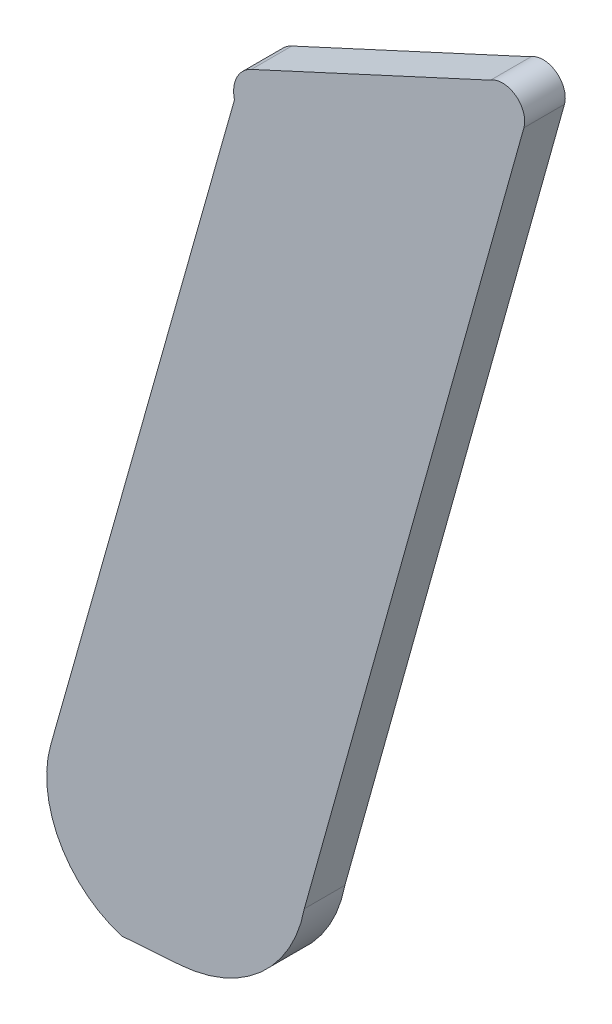
ISO-10303-21;
HEADER;
FILE_DESCRIPTION(('STEP AP214'),'2;1');
FILE_NAME('part.step','',(''),(''),'','','');
FILE_SCHEMA(('AUTOMOTIVE_DESIGN { 1 0 10303 214 1 1 1 1 }'));
ENDSEC;
DATA;
#1=APPLICATION_CONTEXT('core data for automotive mechanical design processes');
#2=APPLICATION_PROTOCOL_DEFINITION('international standard','automotive_design',2000,#1);
#3=PRODUCT_CONTEXT('',#1,'mechanical');
#4=PRODUCT('Part','Part','',(#3));
#5=PRODUCT_RELATED_PRODUCT_CATEGORY('part','',(#4));
#6=PRODUCT_DEFINITION_FORMATION('','',#4);
#7=PRODUCT_DEFINITION_CONTEXT('part definition',#1,'design');
#8=PRODUCT_DEFINITION('design','',#6,#7);
#9=PRODUCT_DEFINITION_SHAPE('','',#8);
#10=(LENGTH_UNIT() NAMED_UNIT(*) SI_UNIT(.MILLI.,.METRE.));
#11=(NAMED_UNIT(*) PLANE_ANGLE_UNIT() SI_UNIT($,.RADIAN.));
#12=(NAMED_UNIT(*) SI_UNIT($,.STERADIAN.) SOLID_ANGLE_UNIT());
#13=UNCERTAINTY_MEASURE_WITH_UNIT(LENGTH_MEASURE(1.E-05),#10,'distance_accuracy_value','');
#14=(GEOMETRIC_REPRESENTATION_CONTEXT(3) GLOBAL_UNCERTAINTY_ASSIGNED_CONTEXT((#13)) GLOBAL_UNIT_ASSIGNED_CONTEXT((#10,
#11,#12)) REPRESENTATION_CONTEXT('',''));
#15=CARTESIAN_POINT('',(0.,0.,0.));
#16=DIRECTION('',(0.,0.,1.));
#17=DIRECTION('',(1.,0.,0.));
#18=AXIS2_PLACEMENT_3D('',#15,#16,#17);
#19=CARTESIAN_POINT('',(5.99324054158584,12.2028364475582,4.75));
#20=DIRECTION('',(0.,0.,1.));
#21=DIRECTION('',(1.,0.,0.));
#22=AXIS2_PLACEMENT_3D('',#19,#20,#21);
#23=PLANE('',#22);
#24=CARTESIAN_POINT('',(5.99324054158584,12.2028364475582,4.75));
#25=DIRECTION('',(0.,0.,1.));
#26=DIRECTION('',(-0.962500176709343,0.271281053216925,0.));
#27=AXIS2_PLACEMENT_3D('',#24,#25,#26);
#28=CIRCLE('',#27,0.00520782048819952);
#29=CARTESIAN_POINT('',(5.98822801344569,12.2042492305852,4.75));
#30=VERTEX_POINT('',#29);
#31=CARTESIAN_POINT('',(5.99173305629249,12.1978515822312,4.75));
#32=VERTEX_POINT('',#31);
#33=EDGE_CURVE('E11',#30,#32,#28,.T.);
#34=ORIENTED_EDGE('',*,*,#33,.F.);
#35=DIRECTION('',(-0.271800434966831,-0.962353637470053,0.));
#36=VECTOR('',#35,1.);
#37=CARTESIAN_POINT('',(5.99729392063709,12.2363485492036,4.75));
#38=LINE('',#37,#36);
#39=CARTESIAN_POINT('',(5.99729392063709,12.2363485492036,4.75));
#40=VERTEX_POINT('',#39);
#41=EDGE_CURVE('E149',#40,#30,#38,.T.);
#42=ORIENTED_EDGE('',*,*,#41,.F.);
#43=CARTESIAN_POINT('',(5.99875541794067,12.2366986419914,4.75));
#44=DIRECTION('',(0.,0.,1.));
#45=DIRECTION('',(-0.418762389529614,0.90809584357349,0.));
#46=AXIS2_PLACEMENT_3D('',#43,#44,#45);
#47=CIRCLE('',#46,0.0015028437471875);
#48=CARTESIAN_POINT('',(5.99812608350199,12.2380633681518,4.75));
#49=VERTEX_POINT('',#48);
#50=EDGE_CURVE('E142',#49,#40,#47,.T.);
#51=ORIENTED_EDGE('',*,*,#50,.F.);
#52=DIRECTION('',(-0.908095843567235,-0.418762389543178,0.));
#53=VECTOR('',#52,1.);
#54=CARTESIAN_POINT('',(6.00992348274227,12.24350366075,4.75));
#55=LINE('',#54,#53);
#56=CARTESIAN_POINT('',(6.00992348274227,12.24350366075,4.75));
#57=VERTEX_POINT('',#56);
#58=EDGE_CURVE('E133',#57,#49,#55,.T.);
#59=ORIENTED_EDGE('',*,*,#58,.F.);
#60=CARTESIAN_POINT('',(6.01051791311115,12.2425869628833,4.75));
#61=DIRECTION('',(0.,0.,1.));
#62=DIRECTION('',(0.963136685559249,-0.269012499579377,0.));
#63=AXIS2_PLACEMENT_3D('',#60,#61,#62);
#64=CIRCLE('',#63,0.00109255775237677);
#65=CARTESIAN_POINT('',(6.01157019556355,12.2422930511914,4.75));
#66=VERTEX_POINT('',#65);
#67=EDGE_CURVE('E124',#66,#57,#64,.T.);
#68=ORIENTED_EDGE('',*,*,#67,.F.);
#69=DIRECTION('',(0.269012499581257,0.963136685558724,0.));
#70=VECTOR('',#69,1.);
#71=CARTESIAN_POINT('',(6.00074015208099,12.2035185994448,4.75));
#72=LINE('',#71,#70);
#73=CARTESIAN_POINT('',(6.00074015208099,12.2035185994448,4.75));
#74=VERTEX_POINT('',#73);
#75=EDGE_CURVE('E115',#74,#66,#72,.T.);
#76=ORIENTED_EDGE('',*,*,#75,.F.);
#77=CARTESIAN_POINT('',(5.99411955995918,12.2047784362287,4.75));
#78=DIRECTION('',(0.,0.,1.));
#79=DIRECTION('',(0.0711865301073218,-0.997463020833995,0.));
#80=AXIS2_PLACEMENT_3D('',#77,#78,#79);
#81=CIRCLE('',#80,0.0067393937980794);
#82=CARTESIAN_POINT('',(5.99459931401869,12.1980561401323,4.75));
#83=VERTEX_POINT('',#82);
#84=EDGE_CURVE('E106',#83,#74,#81,.T.);
#85=ORIENTED_EDGE('',*,*,#84,.F.);
#86=DIRECTION('',(0.997463020833723,0.0711865301111404,0.));
#87=VECTOR('',#86,1.);
#88=CARTESIAN_POINT('',(5.99173305629249,12.1978515822312,4.75));
#89=LINE('',#88,#87);
#90=EDGE_CURVE('E86',#32,#83,#89,.T.);
#91=ORIENTED_EDGE('',*,*,#90,.F.);
#92=EDGE_LOOP('',(#34,#42,#51,#59,#68,#76,#85,#91));
#93=FACE_BOUND('',#92,.T.);
#94=ADVANCED_FACE('F17',(#93),#23,.F.);
#95=CARTESIAN_POINT('',(5.99729392063709,12.2363485492036,4.83252449867128));
#96=DIRECTION('',(0.962353637470054,-0.271800434966827,0.));
#97=DIRECTION('',(0.271800434966827,0.962353637470054,0.));
#98=AXIS2_PLACEMENT_3D('',#95,#96,#97);
#99=PLANE('',#98);
#100=DIRECTION('',(0.,0.,-1.));
#101=VECTOR('',#100,1.);
#102=CARTESIAN_POINT('',(5.98822801344569,12.2042492305852,4.752));
#103=LINE('',#102,#101);
#104=CARTESIAN_POINT('',(5.98822801344569,12.2042492305852,4.752));
#105=VERTEX_POINT('',#104);
#106=EDGE_CURVE('E24',#105,#30,#103,.T.);
#107=ORIENTED_EDGE('',*,*,#106,.F.);
#108=DIRECTION('',(0.271800434966806,0.96235363747006,0.));
#109=VECTOR('',#108,1.);
#110=CARTESIAN_POINT('',(5.98822801344568,12.2042492305852,4.752));
#111=LINE('',#110,#109);
#112=CARTESIAN_POINT('',(5.99729392063709,12.2363485492036,4.752));
#113=VERTEX_POINT('',#112);
#114=EDGE_CURVE('E99',#105,#113,#111,.T.);
#115=ORIENTED_EDGE('',*,*,#114,.T.);
#116=DIRECTION('',(-4.44089209849914E-13,0.,-1.));
#117=VECTOR('',#116,1.);
#118=CARTESIAN_POINT('',(5.99729392063709,12.2363485492036,4.752));
#119=LINE('',#118,#117);
#120=EDGE_CURVE('E146',#113,#40,#119,.T.);
#121=ORIENTED_EDGE('',*,*,#120,.T.);
#122=ORIENTED_EDGE('',*,*,#41,.T.);
#123=EDGE_LOOP('',(#107,#115,#121,#122));
#124=FACE_BOUND('',#123,.T.);
#125=ADVANCED_FACE('F150',(#124),#99,.F.);
#126=CARTESIAN_POINT('',(5.99875541794067,12.2366986419914,4.83252449867128));
#127=DIRECTION('',(0.,0.,-1.));
#128=DIRECTION('',(-1.,0.,0.));
#129=AXIS2_PLACEMENT_3D('',#126,#127,#128);
#130=CYLINDRICAL_SURFACE('',#129,0.0015028437471875);
#131=ORIENTED_EDGE('',*,*,#120,.F.);
#132=CARTESIAN_POINT('',(5.99875541794067,12.2366986419914,4.752));
#133=DIRECTION('',(0.,0.,-1.));
#134=DIRECTION('',(-0.972487862641351,-0.232953551196923,0.));
#135=AXIS2_PLACEMENT_3D('',#132,#133,#134);
#136=CIRCLE('',#135,0.0015028437471875);
#137=CARTESIAN_POINT('',(5.99812608350199,12.2380633681518,4.752));
#138=VERTEX_POINT('',#137);
#139=EDGE_CURVE('E136',#113,#138,#136,.T.);
#140=ORIENTED_EDGE('',*,*,#139,.T.);
#141=DIRECTION('',(0.,-8.88178419699829E-13,-1.));
#142=VECTOR('',#141,1.);
#143=CARTESIAN_POINT('',(5.99812608350199,12.2380633681518,4.752));
#144=LINE('',#143,#142);
#145=EDGE_CURVE('E139',#138,#49,#144,.T.);
#146=ORIENTED_EDGE('',*,*,#145,.T.);
#147=ORIENTED_EDGE('',*,*,#50,.T.);
#148=EDGE_LOOP('',(#131,#140,#146,#147));
#149=FACE_BOUND('',#148,.T.);
#150=ADVANCED_FACE('F152',(#149),#130,.T.);
#151=CARTESIAN_POINT('',(6.00992348274227,12.24350366075,4.83252449867128));
#152=DIRECTION('',(0.418762389543199,-0.908095843567225,0.));
#153=DIRECTION('',(0.908095843567225,0.418762389543199,0.));
#154=AXIS2_PLACEMENT_3D('',#151,#152,#153);
#155=PLANE('',#154);
#156=ORIENTED_EDGE('',*,*,#145,.F.);
#157=DIRECTION('',(0.908095843567247,0.418762389543152,0.));
#158=VECTOR('',#157,1.);
#159=CARTESIAN_POINT('',(5.99812608350201,12.2380633681518,4.752));
#160=LINE('',#159,#158);
#161=CARTESIAN_POINT('',(6.00992348274227,12.24350366075,4.752));
#162=VERTEX_POINT('',#161);
#163=EDGE_CURVE('E127',#138,#162,#160,.T.);
#164=ORIENTED_EDGE('',*,*,#163,.T.);
#165=DIRECTION('',(0.,8.88178419699829E-13,-1.));
#166=VECTOR('',#165,1.);
#167=CARTESIAN_POINT('',(6.00992348274227,12.24350366075,4.752));
#168=LINE('',#167,#166);
#169=EDGE_CURVE('E130',#162,#57,#168,.T.);
#170=ORIENTED_EDGE('',*,*,#169,.T.);
#171=ORIENTED_EDGE('',*,*,#58,.T.);
#172=EDGE_LOOP('',(#156,#164,#170,#171));
#173=FACE_BOUND('',#172,.T.);
#174=ADVANCED_FACE('F155',(#173),#155,.F.);
#175=CARTESIAN_POINT('',(6.01051791311115,12.2425869628833,4.83252449867128));
#176=DIRECTION('',(0.,0.,-1.));
#177=DIRECTION('',(0.592324172555314,0.805699742215835,0.));
#178=AXIS2_PLACEMENT_3D('',#175,#176,#177);
#179=CYLINDRICAL_SURFACE('',#178,0.00109255775237677);
#180=ORIENTED_EDGE('',*,*,#169,.F.);
#181=CARTESIAN_POINT('',(6.01051791311115,12.2425869628833,4.752));
#182=DIRECTION('',(0.,0.,-1.));
#183=DIRECTION('',(-0.544072263083666,0.839038361782713,0.));
#184=AXIS2_PLACEMENT_3D('',#181,#182,#183);
#185=CIRCLE('',#184,0.00109255775237677);
#186=CARTESIAN_POINT('',(6.01157019556355,12.2422930511914,4.752));
#187=VERTEX_POINT('',#186);
#188=EDGE_CURVE('E118',#162,#187,#185,.T.);
#189=ORIENTED_EDGE('',*,*,#188,.T.);
#190=DIRECTION('',(0.,0.,-1.));
#191=VECTOR('',#190,1.);
#192=CARTESIAN_POINT('',(6.01157019556355,12.2422930511914,4.752));
#193=LINE('',#192,#191);
#194=EDGE_CURVE('E121',#187,#66,#193,.T.);
#195=ORIENTED_EDGE('',*,*,#194,.T.);
#196=ORIENTED_EDGE('',*,*,#67,.T.);
#197=EDGE_LOOP('',(#180,#189,#195,#196));
#198=FACE_BOUND('',#197,.T.);
#199=ADVANCED_FACE('F158',(#198),#179,.T.);
#200=CARTESIAN_POINT('',(6.00074015208099,12.2035185994448,4.83252449867128));
#201=DIRECTION('',(-0.963136685558727,0.269012499581246,0.));
#202=DIRECTION('',(-0.269012499581246,-0.963136685558727,0.));
#203=AXIS2_PLACEMENT_3D('',#200,#201,#202);
#204=PLANE('',#203);
#205=ORIENTED_EDGE('',*,*,#194,.F.);
#206=DIRECTION('',(-0.269012499581246,-0.963136685558727,0.));
#207=VECTOR('',#206,1.);
#208=CARTESIAN_POINT('',(6.01157019556355,12.2422930511914,4.752));
#209=LINE('',#208,#207);
#210=CARTESIAN_POINT('',(6.00074015208099,12.2035185994448,4.752));
#211=VERTEX_POINT('',#210);
#212=EDGE_CURVE('E109',#187,#211,#209,.T.);
#213=ORIENTED_EDGE('',*,*,#212,.T.);
#214=DIRECTION('',(0.,0.,-1.));
#215=VECTOR('',#214,1.);
#216=CARTESIAN_POINT('',(6.00074015208099,12.2035185994448,4.752));
#217=LINE('',#216,#215);
#218=EDGE_CURVE('E112',#211,#74,#217,.T.);
#219=ORIENTED_EDGE('',*,*,#218,.T.);
#220=ORIENTED_EDGE('',*,*,#75,.T.);
#221=EDGE_LOOP('',(#205,#213,#219,#220));
#222=FACE_BOUND('',#221,.T.);
#223=ADVANCED_FACE('F160',(#222),#204,.F.);
#224=CARTESIAN_POINT('',(5.99411955995918,12.2047784362287,4.83252449867128));
#225=DIRECTION('',(0.,0.,-1.));
#226=DIRECTION('',(-1.,0.,0.));
#227=AXIS2_PLACEMENT_3D('',#224,#225,#226);
#228=CYLINDRICAL_SURFACE('',#227,0.0067393937980794);
#229=ORIENTED_EDGE('',*,*,#218,.F.);
#230=CARTESIAN_POINT('',(5.99411955995918,12.2047784362287,4.752));
#231=DIRECTION('',(0.,0.,-1.));
#232=DIRECTION('',(0.982372053063257,-0.186936217358441,0.));
#233=AXIS2_PLACEMENT_3D('',#230,#231,#232);
#234=CIRCLE('',#233,0.0067393937980794);
#235=CARTESIAN_POINT('',(5.99459931401869,12.1980561401323,4.752));
#236=VERTEX_POINT('',#235);
#237=EDGE_CURVE('E103',#211,#236,#234,.T.);
#238=ORIENTED_EDGE('',*,*,#237,.T.);
#239=DIRECTION('',(-4.44089209849914E-13,0.,-1.));
#240=VECTOR('',#239,1.);
#241=CARTESIAN_POINT('',(5.99459931401869,12.1980561401323,4.752));
#242=LINE('',#241,#240);
#243=EDGE_CURVE('E92',#236,#83,#242,.T.);
#244=ORIENTED_EDGE('',*,*,#243,.T.);
#245=ORIENTED_EDGE('',*,*,#84,.T.);
#246=EDGE_LOOP('',(#229,#238,#244,#245));
#247=FACE_BOUND('',#246,.T.);
#248=ADVANCED_FACE('F163',(#247),#228,.T.);
#249=CARTESIAN_POINT('',(5.99173305629249,12.1978515822312,4.83252449867128));
#250=DIRECTION('',(-0.0711865301114162,0.997463020833703,0.));
#251=DIRECTION('',(-0.997463020833703,-0.0711865301114162,0.));
#252=AXIS2_PLACEMENT_3D('',#249,#250,#251);
#253=PLANE('',#252);
#254=ORIENTED_EDGE('',*,*,#243,.F.);
#255=DIRECTION('',(-0.997463020833767,-0.0711865301105253,3.09087742338964E-13));
#256=VECTOR('',#255,1.);
#257=CARTESIAN_POINT('',(5.99459931401869,12.1980561401323,4.752));
#258=LINE('',#257,#256);
#259=CARTESIAN_POINT('',(5.99173305629249,12.1978515822312,4.752));
#260=VERTEX_POINT('',#259);
#261=EDGE_CURVE('E87',#236,#260,#258,.T.);
#262=ORIENTED_EDGE('',*,*,#261,.T.);
#263=DIRECTION('',(0.,-8.88178419699829E-13,-1.));
#264=VECTOR('',#263,1.);
#265=CARTESIAN_POINT('',(5.99173305629249,12.1978515822312,4.752));
#266=LINE('',#265,#264);
#267=EDGE_CURVE('E78',#260,#32,#266,.T.);
#268=ORIENTED_EDGE('',*,*,#267,.T.);
#269=ORIENTED_EDGE('',*,*,#90,.T.);
#270=EDGE_LOOP('',(#254,#262,#268,#269));
#271=FACE_BOUND('',#270,.T.);
#272=ADVANCED_FACE('F90',(#271),#253,.F.);
#273=CARTESIAN_POINT('',(5.99324054158584,12.2028364475582,4.83252449867128));
#274=DIRECTION('',(0.,0.,-1.));
#275=DIRECTION('',(-1.,0.,0.));
#276=AXIS2_PLACEMENT_3D('',#273,#274,#275);
#277=CYLINDRICAL_SURFACE('',#276,0.00520782048819952);
#278=ORIENTED_EDGE('',*,*,#267,.F.);
#279=CARTESIAN_POINT('',(5.99324054158584,12.2028364475582,4.752));
#280=DIRECTION('',(0.,0.,-1.));
#281=DIRECTION('',(-0.289465678924144,-0.957188393538589,0.));
#282=AXIS2_PLACEMENT_3D('',#279,#280,#281);
#283=CIRCLE('',#282,0.00520782048819952);
#284=EDGE_CURVE('E82',#260,#105,#283,.T.);
#285=ORIENTED_EDGE('',*,*,#284,.T.);
#286=ORIENTED_EDGE('',*,*,#106,.T.);
#287=ORIENTED_EDGE('',*,*,#33,.T.);
#288=EDGE_LOOP('',(#278,#285,#286,#287));
#289=FACE_BOUND('',#288,.T.);
#290=ADVANCED_FACE('F80',(#289),#277,.T.);
#291=CARTESIAN_POINT('',(5.86959286961936,12.1314924009898,4.752));
#292=DIRECTION('',(0.,0.,-1.));
#293=DIRECTION('',(-1.,0.,0.));
#294=AXIS2_PLACEMENT_3D('',#291,#292,#293);
#295=PLANE('',#294);
#296=ORIENTED_EDGE('',*,*,#261,.F.);
#297=ORIENTED_EDGE('',*,*,#237,.F.);
#298=ORIENTED_EDGE('',*,*,#212,.F.);
#299=ORIENTED_EDGE('',*,*,#188,.F.);
#300=ORIENTED_EDGE('',*,*,#163,.F.);
#301=ORIENTED_EDGE('',*,*,#139,.F.);
#302=ORIENTED_EDGE('',*,*,#114,.F.);
#303=ORIENTED_EDGE('',*,*,#284,.F.);
#304=EDGE_LOOP('',(#296,#297,#298,#299,#300,#301,#302,#303));
#305=FACE_BOUND('',#304,.T.);
#306=ADVANCED_FACE('F97',(#305),#295,.F.);
#307=CLOSED_SHELL('',(#94,#125,#150,#174,#199,#223,#248,#272,#290,#306));
#308=MANIFOLD_SOLID_BREP('B1',#307);
#309=ADVANCED_BREP_SHAPE_REPRESENTATION('',(#18,#308),#14);
#310=SHAPE_DEFINITION_REPRESENTATION(#9,#309);
ENDSEC;
END-ISO-10303-21;
